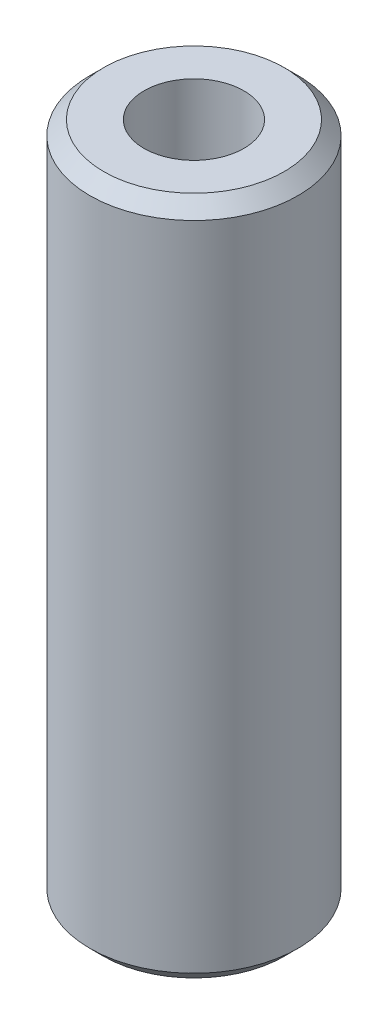
ISO-10303-21;
HEADER;
FILE_DESCRIPTION(('STEP AP214'),'2;1');
FILE_NAME('part.step','',(''),(''),'','','');
FILE_SCHEMA(('AUTOMOTIVE_DESIGN { 1 0 10303 214 1 1 1 1 }'));
ENDSEC;
DATA;
#1=APPLICATION_CONTEXT('core data for automotive mechanical design processes');
#2=APPLICATION_PROTOCOL_DEFINITION('international standard','automotive_design',2000,#1);
#3=PRODUCT_CONTEXT('',#1,'mechanical');
#4=PRODUCT('Part','Part','',(#3));
#5=PRODUCT_RELATED_PRODUCT_CATEGORY('part','',(#4));
#6=PRODUCT_DEFINITION_FORMATION('','',#4);
#7=PRODUCT_DEFINITION_CONTEXT('part definition',#1,'design');
#8=PRODUCT_DEFINITION('design','',#6,#7);
#9=PRODUCT_DEFINITION_SHAPE('','',#8);
#10=(LENGTH_UNIT() NAMED_UNIT(*) SI_UNIT(.MILLI.,.METRE.));
#11=(NAMED_UNIT(*) PLANE_ANGLE_UNIT() SI_UNIT($,.RADIAN.));
#12=(NAMED_UNIT(*) SI_UNIT($,.STERADIAN.) SOLID_ANGLE_UNIT());
#13=UNCERTAINTY_MEASURE_WITH_UNIT(LENGTH_MEASURE(1.E-05),#10,'distance_accuracy_value','');
#14=(GEOMETRIC_REPRESENTATION_CONTEXT(3) GLOBAL_UNCERTAINTY_ASSIGNED_CONTEXT((#13)) GLOBAL_UNIT_ASSIGNED_CONTEXT((#10,
#11,#12)) REPRESENTATION_CONTEXT('',''));
#15=CARTESIAN_POINT('',(0.,0.,0.));
#16=DIRECTION('',(0.,0.,1.));
#17=DIRECTION('',(1.,0.,0.));
#18=AXIS2_PLACEMENT_3D('',#15,#16,#17);
#19=CARTESIAN_POINT('',(0.,293.887048247519,0.));
#20=DIRECTION('',(0.,-1.,0.));
#21=DIRECTION('',(0.,0.,-1.));
#22=AXIS2_PLACEMENT_3D('',#19,#20,#21);
#23=CYLINDRICAL_SURFACE('',#22,45.);
#24=CARTESIAN_POINT('',(0.,287.89613352961,0.));
#25=DIRECTION('',(0.,1.,0.));
#26=DIRECTION('',(0.,0.,1.));
#27=AXIS2_PLACEMENT_3D('',#24,#25,#26);
#28=CIRCLE('',#27,45.);
#29=CARTESIAN_POINT('',(0.,287.89613352961,45.));
#30=VERTEX_POINT('',#29);
#31=EDGE_CURVE('E50',#30,#30,#28,.F.);
#32=ORIENTED_EDGE('',*,*,#31,.T.);
#33=EDGE_LOOP('',(#32));
#34=FACE_BOUND('',#33,.T.);
#35=CARTESIAN_POINT('',(0.,5.99091471790902,0.));
#36=DIRECTION('',(0.,1.,0.));
#37=DIRECTION('',(0.,0.,1.));
#38=AXIS2_PLACEMENT_3D('',#35,#36,#37);
#39=CIRCLE('',#38,45.);
#40=CARTESIAN_POINT('',(0.,5.99091471790902,45.));
#41=VERTEX_POINT('',#40);
#42=EDGE_CURVE('E51',#41,#41,#39,.T.);
#43=ORIENTED_EDGE('',*,*,#42,.T.);
#44=EDGE_LOOP('',(#43));
#45=FACE_BOUND('',#44,.T.);
#46=ADVANCED_FACE('F39',(#34,#45),#23,.T.);
#47=CARTESIAN_POINT('',(0.,293.887048247519,0.));
#48=DIRECTION('',(0.,1.,0.));
#49=DIRECTION('',(0.,0.,1.));
#50=AXIS2_PLACEMENT_3D('',#47,#48,#49);
#51=PLANE('',#50);
#52=CARTESIAN_POINT('',(0.,293.887048247519,0.));
#53=DIRECTION('',(0.,1.,0.));
#54=DIRECTION('',(0.,0.,1.));
#55=AXIS2_PLACEMENT_3D('',#52,#53,#54);
#56=CIRCLE('',#55,39.009085282091);
#57=CARTESIAN_POINT('',(0.,293.887048247519,39.009085282091));
#58=VERTEX_POINT('',#57);
#59=EDGE_CURVE('E54',#58,#58,#56,.T.);
#60=ORIENTED_EDGE('',*,*,#59,.T.);
#61=EDGE_LOOP('',(#60));
#62=FACE_BOUND('',#61,.T.);
#63=CARTESIAN_POINT('',(0.,293.887048247519,0.));
#64=DIRECTION('',(0.,1.,0.));
#65=DIRECTION('',(0.,0.,1.));
#66=AXIS2_PLACEMENT_3D('',#63,#64,#65);
#67=CIRCLE('',#66,21.6078320604885);
#68=CARTESIAN_POINT('',(0.,293.887048247519,21.6078320604885));
#69=VERTEX_POINT('',#68);
#70=EDGE_CURVE('E58',#69,#69,#67,.T.);
#71=ORIENTED_EDGE('',*,*,#70,.F.);
#72=EDGE_LOOP('',(#71));
#73=FACE_BOUND('',#72,.T.);
#74=ADVANCED_FACE('F69',(#62,#73),#51,.T.);
#75=CARTESIAN_POINT('',(0.,0.,0.));
#76=DIRECTION('',(0.,1.,0.));
#77=DIRECTION('',(0.,0.,1.));
#78=AXIS2_PLACEMENT_3D('',#75,#76,#77);
#79=PLANE('',#78);
#80=CARTESIAN_POINT('',(0.,0.,0.));
#81=DIRECTION('',(0.,1.,0.));
#82=DIRECTION('',(0.,0.,1.));
#83=AXIS2_PLACEMENT_3D('',#80,#81,#82);
#84=CIRCLE('',#83,39.0090852820909);
#85=CARTESIAN_POINT('',(0.,0.,39.0090852820909));
#86=VERTEX_POINT('',#85);
#87=EDGE_CURVE('E10',#86,#86,#84,.F.);
#88=ORIENTED_EDGE('',*,*,#87,.T.);
#89=EDGE_LOOP('',(#88));
#90=FACE_BOUND('',#89,.T.);
#91=CARTESIAN_POINT('',(0.,0.,0.));
#92=DIRECTION('',(0.,1.,0.));
#93=DIRECTION('',(0.,0.,1.));
#94=AXIS2_PLACEMENT_3D('',#91,#92,#93);
#95=CIRCLE('',#94,21.6078320604885);
#96=CARTESIAN_POINT('',(0.,0.,21.6078320604885));
#97=VERTEX_POINT('',#96);
#98=EDGE_CURVE('E63',#97,#97,#95,.T.);
#99=ORIENTED_EDGE('',*,*,#98,.T.);
#100=EDGE_LOOP('',(#99));
#101=FACE_BOUND('',#100,.T.);
#102=ADVANCED_FACE('F75',(#90,#101),#79,.F.);
#103=CARTESIAN_POINT('',(0.,293.887048247519,0.));
#104=DIRECTION('',(0.,-1.,0.));
#105=DIRECTION('',(0.,0.,-1.));
#106=AXIS2_PLACEMENT_3D('',#103,#104,#105);
#107=CYLINDRICAL_SURFACE('',#106,21.6078320604885);
#108=ORIENTED_EDGE('',*,*,#70,.T.);
#109=EDGE_LOOP('',(#108));
#110=FACE_BOUND('',#109,.T.);
#111=ORIENTED_EDGE('',*,*,#98,.F.);
#112=EDGE_LOOP('',(#111));
#113=FACE_BOUND('',#112,.T.);
#114=ADVANCED_FACE('F70',(#110,#113),#107,.F.);
#115=CARTESIAN_POINT('',(0.,293.887048247519,0.));
#116=DIRECTION('',(0.,-1.,0.));
#117=DIRECTION('',(0.,0.,-1.));
#118=AXIS2_PLACEMENT_3D('',#115,#116,#117);
#119=CONICAL_SURFACE('',#118,39.009085282091,0.785398163397443);
#120=ORIENTED_EDGE('',*,*,#31,.F.);
#121=EDGE_LOOP('',(#120));
#122=FACE_BOUND('',#121,.T.);
#123=ORIENTED_EDGE('',*,*,#59,.F.);
#124=EDGE_LOOP('',(#123));
#125=FACE_BOUND('',#124,.T.);
#126=ADVANCED_FACE('F81',(#122,#125),#119,.T.);
#127=CARTESIAN_POINT('',(0.,5.99091471790902,0.));
#128=DIRECTION('',(0.,1.,0.));
#129=DIRECTION('',(0.,0.,1.));
#130=AXIS2_PLACEMENT_3D('',#127,#128,#129);
#131=CONICAL_SURFACE('',#130,45.,0.785398163397453);
#132=ORIENTED_EDGE('',*,*,#87,.F.);
#133=EDGE_LOOP('',(#132));
#134=FACE_BOUND('',#133,.T.);
#135=ORIENTED_EDGE('',*,*,#42,.F.);
#136=EDGE_LOOP('',(#135));
#137=FACE_BOUND('',#136,.T.);
#138=ADVANCED_FACE('F45',(#134,#137),#131,.T.);
#139=CLOSED_SHELL('',(#46,#74,#102,#114,#126,#138));
#140=MANIFOLD_SOLID_BREP('B2',#139);
#141=ADVANCED_BREP_SHAPE_REPRESENTATION('',(#18,#140),#14);
#142=SHAPE_DEFINITION_REPRESENTATION(#9,#141);
ENDSEC;
END-ISO-10303-21;
